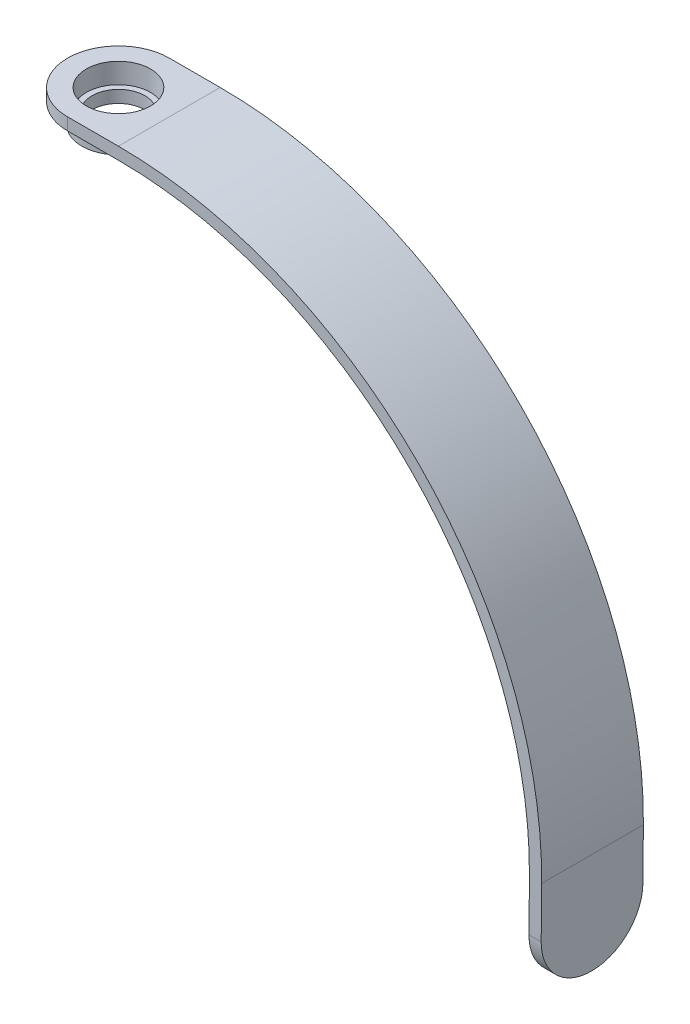
ISO-10303-21;
HEADER;
FILE_DESCRIPTION(('STEP AP214'),'2;1');
FILE_NAME('part.step','',(''),(''),'','','');
FILE_SCHEMA(('AUTOMOTIVE_DESIGN { 1 0 10303 214 1 1 1 1 }'));
ENDSEC;
DATA;
#1=APPLICATION_CONTEXT('core data for automotive mechanical design processes');
#2=APPLICATION_PROTOCOL_DEFINITION('international standard','automotive_design',2000,#1);
#3=PRODUCT_CONTEXT('',#1,'mechanical');
#4=PRODUCT('Part','Part','',(#3));
#5=PRODUCT_RELATED_PRODUCT_CATEGORY('part','',(#4));
#6=PRODUCT_DEFINITION_FORMATION('','',#4);
#7=PRODUCT_DEFINITION_CONTEXT('part definition',#1,'design');
#8=PRODUCT_DEFINITION('design','',#6,#7);
#9=PRODUCT_DEFINITION_SHAPE('','',#8);
#10=(LENGTH_UNIT() NAMED_UNIT(*) SI_UNIT(.MILLI.,.METRE.));
#11=(NAMED_UNIT(*) PLANE_ANGLE_UNIT() SI_UNIT($,.RADIAN.));
#12=(NAMED_UNIT(*) SI_UNIT($,.STERADIAN.) SOLID_ANGLE_UNIT());
#13=UNCERTAINTY_MEASURE_WITH_UNIT(LENGTH_MEASURE(1.E-05),#10,'distance_accuracy_value','');
#14=(GEOMETRIC_REPRESENTATION_CONTEXT(3) GLOBAL_UNCERTAINTY_ASSIGNED_CONTEXT((#13)) GLOBAL_UNIT_ASSIGNED_CONTEXT((#10,
#11,#12)) REPRESENTATION_CONTEXT('',''));
#15=CARTESIAN_POINT('',(0.,0.,0.));
#16=DIRECTION('',(0.,0.,1.));
#17=DIRECTION('',(1.,0.,0.));
#18=AXIS2_PLACEMENT_3D('',#15,#16,#17);
#19=CARTESIAN_POINT('',(0.,0.,25.));
#20=DIRECTION('',(0.,0.,-1.));
#21=DIRECTION('',(-1.,0.,0.));
#22=AXIS2_PLACEMENT_3D('',#19,#20,#21);
#23=CYLINDRICAL_SURFACE('',#22,101.);
#24=CARTESIAN_POINT('',(0.,0.,0.));
#25=DIRECTION('',(0.,0.,-1.));
#26=DIRECTION('',(-1.,0.,0.));
#27=AXIS2_PLACEMENT_3D('',#24,#25,#26);
#28=CIRCLE('',#27,101.);
#29=CARTESIAN_POINT('',(0.,101.,0.));
#30=VERTEX_POINT('',#29);
#31=CARTESIAN_POINT('',(100.996154229481,-0.881380085336104,0.));
#32=VERTEX_POINT('',#31);
#33=EDGE_CURVE('E150',#30,#32,#28,.T.);
#34=ORIENTED_EDGE('',*,*,#33,.T.);
#35=DIRECTION('',(0.,0.,-1.));
#36=VECTOR('',#35,1.);
#37=CARTESIAN_POINT('',(100.996154229481,-0.881380085336104,25.));
#38=LINE('',#37,#36);
#39=CARTESIAN_POINT('',(100.996154229481,-0.881380085336104,25.));
#40=VERTEX_POINT('',#39);
#41=EDGE_CURVE('E129',#40,#32,#38,.T.);
#42=ORIENTED_EDGE('',*,*,#41,.F.);
#43=CARTESIAN_POINT('',(0.,0.,25.));
#44=DIRECTION('',(0.,0.,-1.));
#45=DIRECTION('',(-1.,0.,0.));
#46=AXIS2_PLACEMENT_3D('',#43,#44,#45);
#47=CIRCLE('',#46,101.);
#48=CARTESIAN_POINT('',(0.,101.,25.));
#49=VERTEX_POINT('',#48);
#50=EDGE_CURVE('E137',#49,#40,#47,.T.);
#51=ORIENTED_EDGE('',*,*,#50,.F.);
#52=DIRECTION('',(0.,0.,-1.));
#53=VECTOR('',#52,1.);
#54=CARTESIAN_POINT('',(0.,101.,25.));
#55=LINE('',#54,#53);
#56=EDGE_CURVE('E226',#49,#30,#55,.T.);
#57=ORIENTED_EDGE('',*,*,#56,.T.);
#58=EDGE_LOOP('',(#34,#42,#51,#57));
#59=FACE_BOUND('',#58,.T.);
#60=ADVANCED_FACE('F44',(#59),#23,.F.);
#61=CARTESIAN_POINT('',(100.996154229481,-0.881380085336104,25.));
#62=DIRECTION('',(0.999961923064171,-0.00872653549837732,0.));
#63=DIRECTION('',(0.00872653549837732,0.999961923064171,0.));
#64=AXIS2_PLACEMENT_3D('',#61,#62,#63);
#65=PLANE('',#64);
#66=CARTESIAN_POINT('',(100.887072535752,-13.3809041236382,12.5));
#67=DIRECTION('',(0.999961923064171,-0.00872653549837732,0.));
#68=DIRECTION('',(0.00872653549837732,0.999961923064171,0.));
#69=AXIS2_PLACEMENT_3D('',#66,#67,#68);
#70=CIRCLE('',#69,3.225);
#71=CARTESIAN_POINT('',(100.915215612734,-10.1560269217563,12.5));
#72=VERTEX_POINT('',#71);
#73=EDGE_CURVE('E11',#72,#72,#70,.F.);
#74=ORIENTED_EDGE('',*,*,#73,.F.);
#75=EDGE_LOOP('',(#74));
#76=FACE_BOUND('',#75,.T.);
#77=DIRECTION('',(-0.00872653549837732,-0.999961923064171,0.));
#78=VECTOR('',#77,1.);
#79=CARTESIAN_POINT('',(100.996154229481,-0.881380085336104,0.));
#80=LINE('',#79,#78);
#81=CARTESIAN_POINT('',(100.887072535752,-13.3809041236382,0.));
#82=VERTEX_POINT('',#81);
#83=EDGE_CURVE('E229',#32,#82,#80,.T.);
#84=ORIENTED_EDGE('',*,*,#83,.T.);
#85=CARTESIAN_POINT('',(100.887072535752,-13.3809041236382,12.5));
#86=DIRECTION('',(0.999961923064171,-0.00872653549837732,0.));
#87=DIRECTION('',(0.00872653549837732,0.999961923064171,0.));
#88=AXIS2_PLACEMENT_3D('',#85,#86,#87);
#89=CIRCLE('',#88,12.5);
#90=CARTESIAN_POINT('',(100.777990842022,-25.8804281619404,12.5));
#91=VERTEX_POINT('',#90);
#92=EDGE_CURVE('E175',#82,#91,#89,.F.);
#93=ORIENTED_EDGE('',*,*,#92,.T.);
#94=CARTESIAN_POINT('',(100.887072535752,-13.3809041236382,12.5));
#95=DIRECTION('',(0.999961923064171,-0.00872653549837732,0.));
#96=DIRECTION('',(0.00872653549837732,0.999961923064171,0.));
#97=AXIS2_PLACEMENT_3D('',#94,#95,#96);
#98=CIRCLE('',#97,12.5);
#99=CARTESIAN_POINT('',(100.887072535752,-13.3809041236382,25.));
#100=VERTEX_POINT('',#99);
#101=EDGE_CURVE('E132',#91,#100,#98,.F.);
#102=ORIENTED_EDGE('',*,*,#101,.T.);
#103=DIRECTION('',(-0.00872653549837732,-0.999961923064171,0.));
#104=VECTOR('',#103,1.);
#105=CARTESIAN_POINT('',(100.996154229481,-0.881380085336104,25.));
#106=LINE('',#105,#104);
#107=EDGE_CURVE('E124',#40,#100,#106,.T.);
#108=ORIENTED_EDGE('',*,*,#107,.F.);
#109=ORIENTED_EDGE('',*,*,#41,.T.);
#110=EDGE_LOOP('',(#84,#93,#102,#108,#109));
#111=FACE_BOUND('',#110,.T.);
#112=ADVANCED_FACE('F127',(#76,#111),#65,.F.);
#113=CARTESIAN_POINT('',(103.777876611214,-25.9066077684355,25.));
#114=DIRECTION('',(-0.999961923064171,0.00872653549837787,0.));
#115=DIRECTION('',(-0.00872653549837787,-0.999961923064171,0.));
#116=AXIS2_PLACEMENT_3D('',#113,#114,#115);
#117=PLANE('',#116);
#118=CARTESIAN_POINT('',(103.886958304944,-13.4070837301334,12.5));
#119=DIRECTION('',(-0.999961923064171,0.00872653549837787,0.));
#120=DIRECTION('',(-0.00872653549837787,-0.999961923064171,0.));
#121=AXIS2_PLACEMENT_3D('',#118,#119,#120);
#122=CIRCLE('',#121,12.5);
#123=CARTESIAN_POINT('',(103.886958304944,-13.4070837301334,25.));
#124=VERTEX_POINT('',#123);
#125=CARTESIAN_POINT('',(103.777876611214,-25.9066077684355,12.5));
#126=VERTEX_POINT('',#125);
#127=EDGE_CURVE('E152',#124,#126,#122,.F.);
#128=ORIENTED_EDGE('',*,*,#127,.T.);
#129=CARTESIAN_POINT('',(103.886958304944,-13.4070837301334,12.5));
#130=DIRECTION('',(-0.999961923064171,0.00872653549837787,0.));
#131=DIRECTION('',(-0.00872653549837787,-0.999961923064171,0.));
#132=AXIS2_PLACEMENT_3D('',#129,#130,#131);
#133=CIRCLE('',#132,12.5);
#134=CARTESIAN_POINT('',(103.886958304944,-13.4070837301334,0.));
#135=VERTEX_POINT('',#134);
#136=EDGE_CURVE('E157',#126,#135,#133,.F.);
#137=ORIENTED_EDGE('',*,*,#136,.T.);
#138=DIRECTION('',(0.00872653549837787,0.999961923064171,0.));
#139=VECTOR('',#138,1.);
#140=CARTESIAN_POINT('',(103.777876611214,-25.9066077684355,0.));
#141=LINE('',#140,#139);
#142=CARTESIAN_POINT('',(103.996039998674,-0.907559691831189,0.));
#143=VERTEX_POINT('',#142);
#144=EDGE_CURVE('E232',#135,#143,#141,.T.);
#145=ORIENTED_EDGE('',*,*,#144,.T.);
#146=DIRECTION('',(0.,0.,-1.));
#147=VECTOR('',#146,1.);
#148=CARTESIAN_POINT('',(103.996039998674,-0.907559691831189,25.));
#149=LINE('',#148,#147);
#150=CARTESIAN_POINT('',(103.996039998674,-0.907559691831189,25.));
#151=VERTEX_POINT('',#150);
#152=EDGE_CURVE('E153',#151,#143,#149,.T.);
#153=ORIENTED_EDGE('',*,*,#152,.F.);
#154=DIRECTION('',(0.00872653549837787,0.999961923064171,0.));
#155=VECTOR('',#154,1.);
#156=CARTESIAN_POINT('',(103.777876611214,-25.9066077684355,25.));
#157=LINE('',#156,#155);
#158=EDGE_CURVE('E136',#124,#151,#157,.T.);
#159=ORIENTED_EDGE('',*,*,#158,.F.);
#160=EDGE_LOOP('',(#128,#137,#145,#153,#159));
#161=FACE_BOUND('',#160,.T.);
#162=ADVANCED_FACE('F265',(#161),#117,.F.);
#163=CARTESIAN_POINT('',(0.,0.,25.));
#164=DIRECTION('',(0.,0.,-1.));
#165=DIRECTION('',(-1.,0.,0.));
#166=AXIS2_PLACEMENT_3D('',#163,#164,#165);
#167=CYLINDRICAL_SURFACE('',#166,104.);
#168=CARTESIAN_POINT('',(0.,0.,0.));
#169=DIRECTION('',(0.,0.,1.));
#170=DIRECTION('',(-1.,0.,0.));
#171=AXIS2_PLACEMENT_3D('',#168,#169,#170);
#172=CIRCLE('',#171,104.);
#173=CARTESIAN_POINT('',(0.,104.,0.));
#174=VERTEX_POINT('',#173);
#175=EDGE_CURVE('E235',#143,#174,#172,.T.);
#176=ORIENTED_EDGE('',*,*,#175,.T.);
#177=DIRECTION('',(0.,0.,-1.));
#178=VECTOR('',#177,1.);
#179=CARTESIAN_POINT('',(0.,104.,25.));
#180=LINE('',#179,#178);
#181=CARTESIAN_POINT('',(0.,104.,25.));
#182=VERTEX_POINT('',#181);
#183=EDGE_CURVE('E160',#182,#174,#180,.T.);
#184=ORIENTED_EDGE('',*,*,#183,.F.);
#185=CARTESIAN_POINT('',(0.,0.,25.));
#186=DIRECTION('',(0.,0.,1.));
#187=DIRECTION('',(-1.,0.,0.));
#188=AXIS2_PLACEMENT_3D('',#185,#186,#187);
#189=CIRCLE('',#188,104.);
#190=EDGE_CURVE('E217',#151,#182,#189,.T.);
#191=ORIENTED_EDGE('',*,*,#190,.F.);
#192=ORIENTED_EDGE('',*,*,#152,.T.);
#193=EDGE_LOOP('',(#176,#184,#191,#192));
#194=FACE_BOUND('',#193,.T.);
#195=ADVANCED_FACE('F263',(#194),#167,.T.);
#196=CARTESIAN_POINT('',(0.,104.,25.));
#197=DIRECTION('',(0.,-1.,0.));
#198=DIRECTION('',(0.,0.,-1.));
#199=AXIS2_PLACEMENT_3D('',#196,#197,#198);
#200=PLANE('',#199);
#201=CARTESIAN_POINT('',(-12.5,104.,12.5));
#202=DIRECTION('',(0.,-1.,0.));
#203=DIRECTION('',(0.,0.,-1.));
#204=AXIS2_PLACEMENT_3D('',#201,#202,#203);
#205=CIRCLE('',#204,7.89);
#206=CARTESIAN_POINT('',(-12.5,104.,4.61));
#207=VERTEX_POINT('',#206);
#208=EDGE_CURVE('E343',#207,#207,#205,.T.);
#209=ORIENTED_EDGE('',*,*,#208,.T.);
#210=EDGE_LOOP('',(#209));
#211=FACE_BOUND('',#210,.T.);
#212=CARTESIAN_POINT('',(-12.5,104.,12.5));
#213=DIRECTION('',(0.,-1.,0.));
#214=DIRECTION('',(0.,0.,-1.));
#215=AXIS2_PLACEMENT_3D('',#212,#213,#214);
#216=CIRCLE('',#215,12.5);
#217=CARTESIAN_POINT('',(-12.5,104.,0.));
#218=VERTEX_POINT('',#217);
#219=CARTESIAN_POINT('',(-25.,104.,12.5));
#220=VERTEX_POINT('',#219);
#221=EDGE_CURVE('E61',#218,#220,#216,.F.);
#222=ORIENTED_EDGE('',*,*,#221,.T.);
#223=CARTESIAN_POINT('',(-12.5,104.,12.5));
#224=DIRECTION('',(0.,-1.,0.));
#225=DIRECTION('',(0.,0.,-1.));
#226=AXIS2_PLACEMENT_3D('',#223,#224,#225);
#227=CIRCLE('',#226,12.5);
#228=CARTESIAN_POINT('',(-12.5,104.,25.));
#229=VERTEX_POINT('',#228);
#230=EDGE_CURVE('E54',#220,#229,#227,.F.);
#231=ORIENTED_EDGE('',*,*,#230,.T.);
#232=DIRECTION('',(-1.,0.,0.));
#233=VECTOR('',#232,1.);
#234=CARTESIAN_POINT('',(0.,104.,25.));
#235=LINE('',#234,#233);
#236=EDGE_CURVE('E220',#182,#229,#235,.T.);
#237=ORIENTED_EDGE('',*,*,#236,.F.);
#238=ORIENTED_EDGE('',*,*,#183,.T.);
#239=DIRECTION('',(-1.,0.,0.));
#240=VECTOR('',#239,1.);
#241=CARTESIAN_POINT('',(0.,104.,0.));
#242=LINE('',#241,#240);
#243=EDGE_CURVE('E238',#174,#218,#242,.T.);
#244=ORIENTED_EDGE('',*,*,#243,.T.);
#245=EDGE_LOOP('',(#222,#231,#237,#238,#244));
#246=FACE_BOUND('',#245,.T.);
#247=ADVANCED_FACE('F249',(#211,#246),#200,.F.);
#248=CARTESIAN_POINT('',(-25.,101.,25.));
#249=DIRECTION('',(0.,1.,0.));
#250=DIRECTION('',(0.,0.,1.));
#251=AXIS2_PLACEMENT_3D('',#248,#249,#250);
#252=PLANE('',#251);
#253=CARTESIAN_POINT('',(-12.5,101.,12.5));
#254=DIRECTION('',(0.,1.,0.));
#255=DIRECTION('',(0.,0.,1.));
#256=AXIS2_PLACEMENT_3D('',#253,#254,#255);
#257=CIRCLE('',#256,9.);
#258=CARTESIAN_POINT('',(-12.5,101.,21.5));
#259=VERTEX_POINT('',#258);
#260=EDGE_CURVE('E211',#259,#259,#257,.T.);
#261=ORIENTED_EDGE('',*,*,#260,.T.);
#262=EDGE_LOOP('',(#261));
#263=FACE_BOUND('',#262,.T.);
#264=DIRECTION('',(1.,0.,0.));
#265=VECTOR('',#264,1.);
#266=CARTESIAN_POINT('',(-25.,101.,25.));
#267=LINE('',#266,#265);
#268=CARTESIAN_POINT('',(-12.5,101.,25.));
#269=VERTEX_POINT('',#268);
#270=EDGE_CURVE('E142',#269,#49,#267,.T.);
#271=ORIENTED_EDGE('',*,*,#270,.F.);
#272=CARTESIAN_POINT('',(-12.5,101.,12.5));
#273=DIRECTION('',(0.,1.,0.));
#274=DIRECTION('',(0.,0.,1.));
#275=AXIS2_PLACEMENT_3D('',#272,#273,#274);
#276=CIRCLE('',#275,12.5);
#277=CARTESIAN_POINT('',(-25.,101.,12.5));
#278=VERTEX_POINT('',#277);
#279=EDGE_CURVE('E69',#269,#278,#276,.F.);
#280=ORIENTED_EDGE('',*,*,#279,.T.);
#281=CARTESIAN_POINT('',(-12.5,101.,12.5));
#282=DIRECTION('',(0.,1.,0.));
#283=DIRECTION('',(0.,0.,1.));
#284=AXIS2_PLACEMENT_3D('',#281,#282,#283);
#285=CIRCLE('',#284,12.5);
#286=CARTESIAN_POINT('',(-12.5,101.,0.));
#287=VERTEX_POINT('',#286);
#288=EDGE_CURVE('E184',#278,#287,#285,.F.);
#289=ORIENTED_EDGE('',*,*,#288,.T.);
#290=DIRECTION('',(1.,0.,0.));
#291=VECTOR('',#290,1.);
#292=CARTESIAN_POINT('',(-25.,101.,0.));
#293=LINE('',#292,#291);
#294=EDGE_CURVE('E147',#287,#30,#293,.T.);
#295=ORIENTED_EDGE('',*,*,#294,.T.);
#296=ORIENTED_EDGE('',*,*,#56,.F.);
#297=EDGE_LOOP('',(#271,#280,#289,#295,#296));
#298=FACE_BOUND('',#297,.T.);
#299=ADVANCED_FACE('F296',(#263,#298),#252,.F.);
#300=CARTESIAN_POINT('',(0.,0.,25.));
#301=DIRECTION('',(0.,0.,-1.));
#302=DIRECTION('',(-1.,0.,0.));
#303=AXIS2_PLACEMENT_3D('',#300,#301,#302);
#304=PLANE('',#303);
#305=ORIENTED_EDGE('',*,*,#107,.T.);
#306=DIRECTION('',(0.999961923064171,-0.00872653549837655,0.));
#307=VECTOR('',#306,1.);
#308=CARTESIAN_POINT('',(-0.109081693729707,-12.4995240383022,25.));
#309=LINE('',#308,#307);
#310=EDGE_CURVE('E181',#100,#124,#309,.T.);
#311=ORIENTED_EDGE('',*,*,#310,.T.);
#312=ORIENTED_EDGE('',*,*,#158,.T.);
#313=ORIENTED_EDGE('',*,*,#190,.T.);
#314=ORIENTED_EDGE('',*,*,#236,.T.);
#315=DIRECTION('',(0.,-1.,0.));
#316=VECTOR('',#315,1.);
#317=CARTESIAN_POINT('',(-12.5,0.,25.));
#318=LINE('',#317,#316);
#319=EDGE_CURVE('E178',#229,#269,#318,.T.);
#320=ORIENTED_EDGE('',*,*,#319,.T.);
#321=ORIENTED_EDGE('',*,*,#270,.T.);
#322=ORIENTED_EDGE('',*,*,#50,.T.);
#323=EDGE_LOOP('',(#305,#311,#312,#313,#314,#320,#321,#322));
#324=FACE_BOUND('',#323,.T.);
#325=ADVANCED_FACE('F140',(#324),#304,.F.);
#326=CARTESIAN_POINT('',(0.,0.,0.));
#327=DIRECTION('',(0.,0.,-1.));
#328=DIRECTION('',(-1.,0.,0.));
#329=AXIS2_PLACEMENT_3D('',#326,#327,#328);
#330=PLANE('',#329);
#331=ORIENTED_EDGE('',*,*,#144,.F.);
#332=DIRECTION('',(0.999961923064171,-0.00872653549837655,0.));
#333=VECTOR('',#332,1.);
#334=CARTESIAN_POINT('',(100.887072535752,-13.3809041236382,0.));
#335=LINE('',#334,#333);
#336=EDGE_CURVE('E169',#135,#82,#335,.F.);
#337=ORIENTED_EDGE('',*,*,#336,.T.);
#338=ORIENTED_EDGE('',*,*,#83,.F.);
#339=ORIENTED_EDGE('',*,*,#33,.F.);
#340=ORIENTED_EDGE('',*,*,#294,.F.);
#341=DIRECTION('',(0.,-1.,0.));
#342=VECTOR('',#341,1.);
#343=CARTESIAN_POINT('',(-12.5,104.,0.));
#344=LINE('',#343,#342);
#345=EDGE_CURVE('E166',#287,#218,#344,.F.);
#346=ORIENTED_EDGE('',*,*,#345,.T.);
#347=ORIENTED_EDGE('',*,*,#243,.F.);
#348=ORIENTED_EDGE('',*,*,#175,.F.);
#349=EDGE_LOOP('',(#331,#337,#338,#339,#340,#346,#347,#348));
#350=FACE_BOUND('',#349,.T.);
#351=ADVANCED_FACE('F255',(#350),#330,.T.);
#352=CARTESIAN_POINT('',(-0.109081693729707,-12.4995240383022,12.5));
#353=DIRECTION('',(0.999961923064171,-0.00872653549837655,0.));
#354=DIRECTION('',(0.00872653549837655,0.999961923064171,0.));
#355=AXIS2_PLACEMENT_3D('',#352,#353,#354);
#356=CYLINDRICAL_SURFACE('',#355,12.5);
#357=ORIENTED_EDGE('',*,*,#310,.F.);
#358=ORIENTED_EDGE('',*,*,#101,.F.);
#359=DIRECTION('',(0.999961923064171,-0.00872653549837655,0.));
#360=VECTOR('',#359,1.);
#361=CARTESIAN_POINT('',(100.777990842022,-25.8804281619404,12.5));
#362=LINE('',#361,#360);
#363=EDGE_CURVE('E193',#126,#91,#362,.F.);
#364=ORIENTED_EDGE('',*,*,#363,.F.);
#365=ORIENTED_EDGE('',*,*,#127,.F.);
#366=EDGE_LOOP('',(#357,#358,#364,#365));
#367=FACE_BOUND('',#366,.T.);
#368=ADVANCED_FACE('F273',(#367),#356,.T.);
#369=CARTESIAN_POINT('',(100.887072535752,-13.3809041236382,12.5));
#370=DIRECTION('',(-0.999961923064171,0.00872653549837655,0.));
#371=DIRECTION('',(-0.00872653549837655,-0.999961923064171,0.));
#372=AXIS2_PLACEMENT_3D('',#369,#370,#371);
#373=CYLINDRICAL_SURFACE('',#372,12.5);
#374=ORIENTED_EDGE('',*,*,#92,.F.);
#375=ORIENTED_EDGE('',*,*,#336,.F.);
#376=ORIENTED_EDGE('',*,*,#136,.F.);
#377=ORIENTED_EDGE('',*,*,#363,.T.);
#378=EDGE_LOOP('',(#374,#375,#376,#377));
#379=FACE_BOUND('',#378,.T.);
#380=ADVANCED_FACE('F270',(#379),#373,.T.);
#381=CARTESIAN_POINT('',(-12.5,104.,12.5));
#382=DIRECTION('',(0.,1.,0.));
#383=DIRECTION('',(0.,0.,1.));
#384=AXIS2_PLACEMENT_3D('',#381,#382,#383);
#385=CYLINDRICAL_SURFACE('',#384,12.5);
#386=DIRECTION('',(0.,-1.,0.));
#387=VECTOR('',#386,1.);
#388=CARTESIAN_POINT('',(-25.,101.,12.5));
#389=LINE('',#388,#387);
#390=EDGE_CURVE('E197',#220,#278,#389,.T.);
#391=ORIENTED_EDGE('',*,*,#390,.F.);
#392=ORIENTED_EDGE('',*,*,#221,.F.);
#393=ORIENTED_EDGE('',*,*,#345,.F.);
#394=ORIENTED_EDGE('',*,*,#288,.F.);
#395=EDGE_LOOP('',(#391,#392,#393,#394));
#396=FACE_BOUND('',#395,.T.);
#397=ADVANCED_FACE('F46',(#396),#385,.T.);
#398=CARTESIAN_POINT('',(-12.5,0.,12.5));
#399=DIRECTION('',(0.,-1.,0.));
#400=DIRECTION('',(0.,0.,-1.));
#401=AXIS2_PLACEMENT_3D('',#398,#399,#400);
#402=CYLINDRICAL_SURFACE('',#401,12.5);
#403=ORIENTED_EDGE('',*,*,#230,.F.);
#404=ORIENTED_EDGE('',*,*,#390,.T.);
#405=ORIENTED_EDGE('',*,*,#279,.F.);
#406=ORIENTED_EDGE('',*,*,#319,.F.);
#407=EDGE_LOOP('',(#403,#404,#405,#406));
#408=FACE_BOUND('',#407,.T.);
#409=ADVANCED_FACE('F260',(#408),#402,.T.);
#410=CARTESIAN_POINT('',(94.8873009973666,-13.328544910648,12.5));
#411=DIRECTION('',(0.999961923064171,-0.00872653549837732,0.));
#412=DIRECTION('',(0.00872653549837733,0.999961923064171,0.));
#413=AXIS2_PLACEMENT_3D('',#410,#411,#412);
#414=CYLINDRICAL_SURFACE('',#413,3.225);
#415=CARTESIAN_POINT('',(94.8873009973666,-13.328544910648,12.5));
#416=DIRECTION('',(-0.999961923064171,0.00872653549837733,0.));
#417=DIRECTION('',(-0.00872653549837733,-0.999961923064171,0.));
#418=AXIS2_PLACEMENT_3D('',#415,#416,#417);
#419=CIRCLE('',#418,3.225);
#420=CARTESIAN_POINT('',(94.8591579203843,-16.5534221125299,12.5));
#421=VERTEX_POINT('',#420);
#422=EDGE_CURVE('E200',#421,#421,#419,.T.);
#423=ORIENTED_EDGE('',*,*,#422,.F.);
#424=EDGE_LOOP('',(#423));
#425=FACE_BOUND('',#424,.T.);
#426=ORIENTED_EDGE('',*,*,#73,.T.);
#427=EDGE_LOOP('',(#426));
#428=FACE_BOUND('',#427,.T.);
#429=ADVANCED_FACE('F303',(#425,#428),#414,.T.);
#430=CARTESIAN_POINT('',(94.8873009973666,-13.328544910648,12.5));
#431=DIRECTION('',(-0.999961923064171,0.00872653549837733,0.));
#432=DIRECTION('',(-0.00872653549837733,-0.999961923064171,0.));
#433=AXIS2_PLACEMENT_3D('',#430,#431,#432);
#434=PLANE('',#433);
#435=ORIENTED_EDGE('',*,*,#422,.T.);
#436=EDGE_LOOP('',(#435));
#437=FACE_BOUND('',#436,.T.);
#438=ADVANCED_FACE('F306',(#437),#434,.T.);
#439=CARTESIAN_POINT('',(-12.5,96.,12.5));
#440=DIRECTION('',(0.,1.,0.));
#441=DIRECTION('',(0.,0.,1.));
#442=AXIS2_PLACEMENT_3D('',#439,#440,#441);
#443=CYLINDRICAL_SURFACE('',#442,9.);
#444=CARTESIAN_POINT('',(-12.5,96.,12.5));
#445=DIRECTION('',(0.,1.,0.));
#446=DIRECTION('',(0.,0.,1.));
#447=AXIS2_PLACEMENT_3D('',#444,#445,#446);
#448=CIRCLE('',#447,9.);
#449=CARTESIAN_POINT('',(-12.5,96.,21.5));
#450=VERTEX_POINT('',#449);
#451=EDGE_CURVE('E205',#450,#450,#448,.T.);
#452=ORIENTED_EDGE('',*,*,#451,.T.);
#453=EDGE_LOOP('',(#452));
#454=FACE_BOUND('',#453,.T.);
#455=ORIENTED_EDGE('',*,*,#260,.F.);
#456=EDGE_LOOP('',(#455));
#457=FACE_BOUND('',#456,.T.);
#458=ADVANCED_FACE('F310',(#454,#457),#443,.T.);
#459=CARTESIAN_POINT('',(-12.5,96.,12.5));
#460=DIRECTION('',(0.,1.,0.));
#461=DIRECTION('',(0.,0.,1.));
#462=AXIS2_PLACEMENT_3D('',#459,#460,#461);
#463=PLANE('',#462);
#464=CARTESIAN_POINT('',(-12.5,96.,12.5));
#465=DIRECTION('',(0.,1.,0.));
#466=DIRECTION('',(0.,0.,1.));
#467=AXIS2_PLACEMENT_3D('',#464,#465,#466);
#468=CIRCLE('',#467,6.5);
#469=CARTESIAN_POINT('',(-12.5,96.,19.));
#470=VERTEX_POINT('',#469);
#471=EDGE_CURVE('E338',#470,#470,#468,.T.);
#472=ORIENTED_EDGE('',*,*,#471,.T.);
#473=EDGE_LOOP('',(#472));
#474=FACE_BOUND('',#473,.T.);
#475=ORIENTED_EDGE('',*,*,#451,.F.);
#476=EDGE_LOOP('',(#475));
#477=FACE_BOUND('',#476,.T.);
#478=ADVANCED_FACE('F313',(#474,#477),#463,.F.);
#479=CARTESIAN_POINT('',(-12.5,96.,12.5));
#480=DIRECTION('',(0.,1.,0.));
#481=DIRECTION('',(0.,0.,1.));
#482=AXIS2_PLACEMENT_3D('',#479,#480,#481);
#483=CYLINDRICAL_SURFACE('',#482,6.5);
#484=CARTESIAN_POINT('',(-12.5,99.,12.5));
#485=DIRECTION('',(0.,-1.,0.));
#486=DIRECTION('',(0.,0.,-1.));
#487=AXIS2_PLACEMENT_3D('',#484,#485,#486);
#488=CIRCLE('',#487,6.5);
#489=CARTESIAN_POINT('',(-12.5,99.,6.));
#490=VERTEX_POINT('',#489);
#491=EDGE_CURVE('E48',#490,#490,#488,.F.);
#492=ORIENTED_EDGE('',*,*,#491,.T.);
#493=EDGE_LOOP('',(#492));
#494=FACE_BOUND('',#493,.T.);
#495=ORIENTED_EDGE('',*,*,#471,.F.);
#496=EDGE_LOOP('',(#495));
#497=FACE_BOUND('',#496,.T.);
#498=ADVANCED_FACE('F317',(#494,#497),#483,.F.);
#499=CARTESIAN_POINT('',(-12.5,99.,12.5));
#500=DIRECTION('',(0.,-1.,0.));
#501=DIRECTION('',(0.,0.,-1.));
#502=AXIS2_PLACEMENT_3D('',#499,#500,#501);
#503=PLANE('',#502);
#504=CARTESIAN_POINT('',(-12.5,99.,12.5));
#505=DIRECTION('',(0.,-1.,0.));
#506=DIRECTION('',(0.,0.,-1.));
#507=AXIS2_PLACEMENT_3D('',#504,#505,#506);
#508=CIRCLE('',#507,7.89);
#509=CARTESIAN_POINT('',(-12.5,99.,4.61));
#510=VERTEX_POINT('',#509);
#511=EDGE_CURVE('E334',#510,#510,#508,.T.);
#512=ORIENTED_EDGE('',*,*,#511,.F.);
#513=EDGE_LOOP('',(#512));
#514=FACE_BOUND('',#513,.T.);
#515=ORIENTED_EDGE('',*,*,#491,.F.);
#516=EDGE_LOOP('',(#515));
#517=FACE_BOUND('',#516,.T.);
#518=ADVANCED_FACE('F321',(#514,#517),#503,.F.);
#519=CARTESIAN_POINT('',(-12.5,99.,12.5));
#520=DIRECTION('',(0.,1.,0.));
#521=DIRECTION('',(0.,0.,1.));
#522=AXIS2_PLACEMENT_3D('',#519,#520,#521);
#523=CYLINDRICAL_SURFACE('',#522,7.89);
#524=ORIENTED_EDGE('',*,*,#511,.T.);
#525=EDGE_LOOP('',(#524));
#526=FACE_BOUND('',#525,.T.);
#527=ORIENTED_EDGE('',*,*,#208,.F.);
#528=EDGE_LOOP('',(#527));
#529=FACE_BOUND('',#528,.T.);
#530=ADVANCED_FACE('F323',(#526,#529),#523,.F.);
#531=CLOSED_SHELL('',(#60,#112,#162,#195,#247,#299,#325,#351,#368,#380,#397,#409,#429,#438,#458,
#478,#498,#518,#530));
#532=MANIFOLD_SOLID_BREP('B2',#531);
#533=ADVANCED_BREP_SHAPE_REPRESENTATION('',(#18,#532),#14);
#534=SHAPE_DEFINITION_REPRESENTATION(#9,#533);
ENDSEC;
END-ISO-10303-21;
